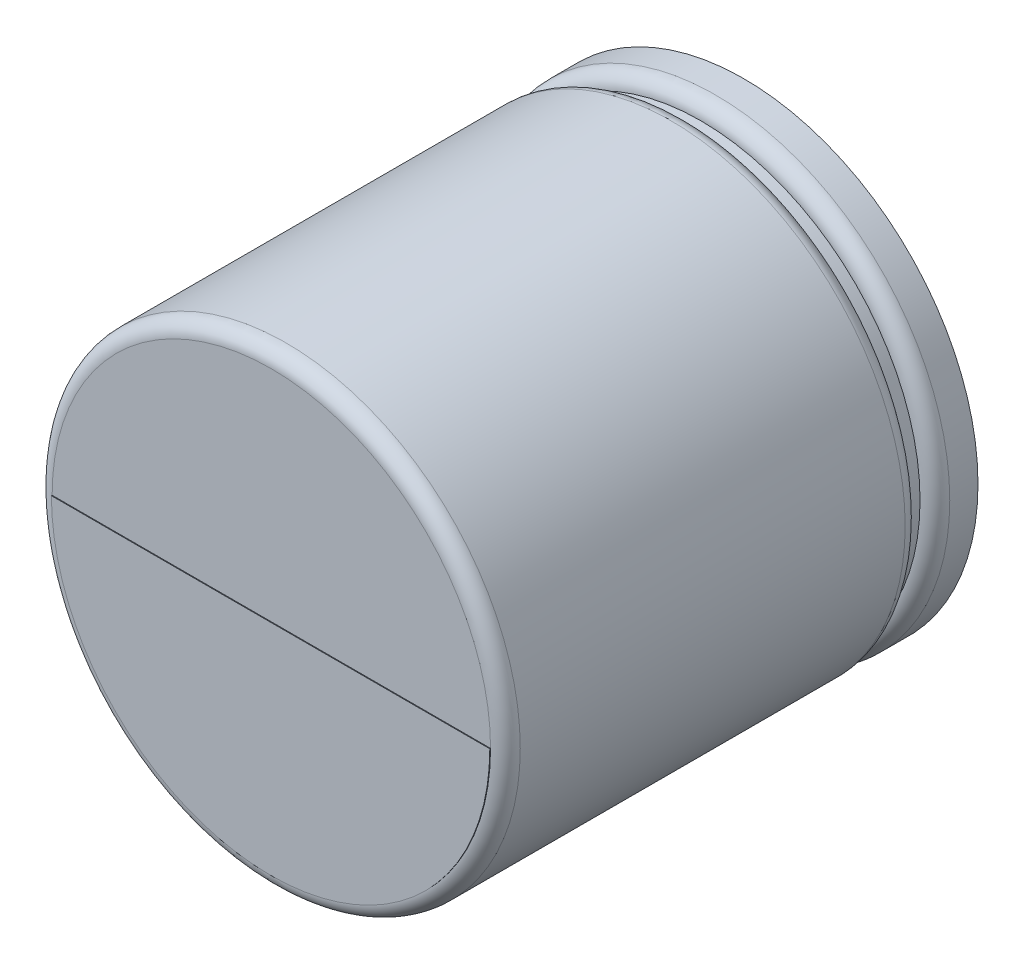
ISO-10303-21;
HEADER;
FILE_DESCRIPTION(('STEP AP214'),'2;1');
FILE_NAME('part.step','',(''),(''),'','','');
FILE_SCHEMA(('AUTOMOTIVE_DESIGN { 1 0 10303 214 1 1 1 1 }'));
ENDSEC;
DATA;
#1=APPLICATION_CONTEXT('core data for automotive mechanical design processes');
#2=APPLICATION_PROTOCOL_DEFINITION('international standard','automotive_design',2000,#1);
#3=PRODUCT_CONTEXT('',#1,'mechanical');
#4=PRODUCT('Part','Part','',(#3));
#5=PRODUCT_RELATED_PRODUCT_CATEGORY('part','',(#4));
#6=PRODUCT_DEFINITION_FORMATION('','',#4);
#7=PRODUCT_DEFINITION_CONTEXT('part definition',#1,'design');
#8=PRODUCT_DEFINITION('design','',#6,#7);
#9=PRODUCT_DEFINITION_SHAPE('','',#8);
#10=(LENGTH_UNIT() NAMED_UNIT(*) SI_UNIT(.MILLI.,.METRE.));
#11=(NAMED_UNIT(*) PLANE_ANGLE_UNIT() SI_UNIT($,.RADIAN.));
#12=(NAMED_UNIT(*) SI_UNIT($,.STERADIAN.) SOLID_ANGLE_UNIT());
#13=UNCERTAINTY_MEASURE_WITH_UNIT(LENGTH_MEASURE(1.E-05),#10,'distance_accuracy_value','');
#14=(GEOMETRIC_REPRESENTATION_CONTEXT(3) GLOBAL_UNCERTAINTY_ASSIGNED_CONTEXT((#13)) GLOBAL_UNIT_ASSIGNED_CONTEXT((#10,
#11,#12)) REPRESENTATION_CONTEXT('',''));
#15=CARTESIAN_POINT('',(0.,0.,0.));
#16=DIRECTION('',(0.,0.,1.));
#17=DIRECTION('',(1.,0.,0.));
#18=AXIS2_PLACEMENT_3D('',#15,#16,#17);
#19=CARTESIAN_POINT('',(3.150002540429,-2.81420062,0.64000126));
#20=DIRECTION('',(0.,0.,-1.));
#21=DIRECTION('',(-1.,0.,0.));
#22=AXIS2_PLACEMENT_3D('',#19,#20,#21);
#23=PLANE('',#22);
#24=CARTESIAN_POINT('',(2.540198607087E-06,-2.81420062,0.64000126));
#25=DIRECTION('',(0.,0.,1.));
#26=DIRECTION('',(1.,0.,0.));
#27=AXIS2_PLACEMENT_3D('',#24,#25,#26);
#28=CIRCLE('',#27,3.15000000023);
#29=CARTESIAN_POINT('',(3.15000254042861,-2.81420062,0.640001259999999));
#30=VERTEX_POINT('',#29);
#31=EDGE_CURVE('E98',#30,#30,#28,.T.);
#32=ORIENTED_EDGE('',*,*,#31,.F.);
#33=EDGE_LOOP('',(#32));
#34=FACE_BOUND('',#33,.T.);
#35=ADVANCED_FACE('F17',(#34),#23,.T.);
#36=CARTESIAN_POINT('',(2.540198607087E-06,-2.81420062,0.64000126));
#37=DIRECTION('',(0.,0.,1.));
#38=DIRECTION('',(1.,0.,0.));
#39=AXIS2_PLACEMENT_3D('',#36,#37,#38);
#40=CYLINDRICAL_SURFACE('',#39,3.15000000023);
#41=ORIENTED_EDGE('',*,*,#31,.T.);
#42=EDGE_LOOP('',(#41));
#43=FACE_BOUND('',#42,.T.);
#44=CARTESIAN_POINT('',(2.540198607015E-06,-2.81420062,1.01999996));
#45=DIRECTION('',(0.,0.,1.));
#46=DIRECTION('',(1.,0.,0.));
#47=AXIS2_PLACEMENT_3D('',#44,#45,#46);
#48=CIRCLE('',#47,3.15000000023);
#49=CARTESIAN_POINT('',(3.15000254042861,-2.81420062,1.01999996));
#50=VERTEX_POINT('',#49);
#51=EDGE_CURVE('E53',#50,#50,#48,.T.);
#52=ORIENTED_EDGE('',*,*,#51,.F.);
#53=EDGE_LOOP('',(#52));
#54=FACE_BOUND('',#53,.T.);
#55=ADVANCED_FACE('F109',(#43,#54),#40,.T.);
#56=CARTESIAN_POINT('',(2.949997460031,-2.81420062,7.01000126));
#57=DIRECTION('',(0.,-1.,0.));
#58=DIRECTION('',(1.,0.,0.));
#59=AXIS2_PLACEMENT_3D('',#56,#57,#58);
#60=PLANE('',#59);
#61=DIRECTION('',(0.,0.,1.));
#62=VECTOR('',#61,1.);
#63=CARTESIAN_POINT('',(-2.949997460031,-2.81420062,7.01000126));
#64=LINE('',#63,#62);
#65=CARTESIAN_POINT('',(-2.9499961899317,-2.81420062,7.01000126));
#66=VERTEX_POINT('',#65);
#67=CARTESIAN_POINT('',(-2.9499966132982,-2.81420062,7.00000125998925));
#68=VERTEX_POINT('',#67);
#69=EDGE_CURVE('E35',#66,#68,#64,.F.);
#70=ORIENTED_EDGE('',*,*,#69,.F.);
#71=DIRECTION('',(1.,0.,0.));
#72=VECTOR('',#71,1.);
#73=CARTESIAN_POINT('',(2.54019860874E-06,-2.81420062,7.01000126));
#74=LINE('',#73,#72);
#75=CARTESIAN_POINT('',(2.9499987301303,-2.81420062,7.01000126));
#76=VERTEX_POINT('',#75);
#77=EDGE_CURVE('E60',#76,#66,#74,.F.);
#78=ORIENTED_EDGE('',*,*,#77,.F.);
#79=DIRECTION('',(0.,0.,1.));
#80=VECTOR('',#79,1.);
#81=CARTESIAN_POINT('',(2.949997460031,-2.81420062,7.01000126));
#82=LINE('',#81,#80);
#83=CARTESIAN_POINT('',(2.9499997507459,-2.81420062,7.00000125999114));
#84=VERTEX_POINT('',#83);
#85=EDGE_CURVE('E43',#84,#76,#82,.T.);
#86=ORIENTED_EDGE('',*,*,#85,.F.);
#87=DIRECTION('',(1.,0.,0.));
#88=VECTOR('',#87,1.);
#89=CARTESIAN_POINT('',(2.540198607794E-06,-2.81420062,7.00000126));
#90=LINE('',#89,#88);
#91=EDGE_CURVE('E56',#68,#84,#90,.T.);
#92=ORIENTED_EDGE('',*,*,#91,.F.);
#93=EDGE_LOOP('',(#70,#78,#86,#92));
#94=FACE_BOUND('',#93,.T.);
#95=ADVANCED_FACE('F57',(#94),#60,.F.);
#96=CARTESIAN_POINT('',(2.540198607015E-06,-2.81420062,1.01999996));
#97=DIRECTION('',(0.,0.,1.));
#98=DIRECTION('',(1.,0.,0.));
#99=AXIS2_PLACEMENT_3D('',#96,#97,#98);
#100=TOROIDAL_SURFACE('',#99,2.950000000229,0.200000000001);
#101=ORIENTED_EDGE('',*,*,#51,.T.);
#102=EDGE_LOOP('',(#101));
#103=FACE_BOUND('',#102,.T.);
#104=CARTESIAN_POINT('',(2.54019860715803E-06,-2.81420062,1.219999960001));
#105=DIRECTION('',(0.,0.,1.));
#106=DIRECTION('',(1.,0.,0.));
#107=AXIS2_PLACEMENT_3D('',#104,#105,#106);
#108=CIRCLE('',#107,2.950000000229);
#109=CARTESIAN_POINT('',(2.95000254042761,-2.81420062,1.219999960001));
#110=VERTEX_POINT('',#109);
#111=EDGE_CURVE('E70',#110,#110,#108,.T.);
#112=ORIENTED_EDGE('',*,*,#111,.F.);
#113=EDGE_LOOP('',(#112));
#114=FACE_BOUND('',#113,.T.);
#115=ADVANCED_FACE('F88',(#103,#114),#100,.T.);
#116=CARTESIAN_POINT('',(2.540198607794E-06,-2.81420062,7.00000126));
#117=DIRECTION('',(0.,0.,1.));
#118=DIRECTION('',(1.,0.,0.));
#119=AXIS2_PLACEMENT_3D('',#116,#117,#118);
#120=PLANE('',#119);
#121=CARTESIAN_POINT('',(2.54019860790649E-06,-2.81420062,7.00000126));
#122=DIRECTION('',(0.,0.,-1.));
#123=DIRECTION('',(-1.,0.,0.));
#124=AXIS2_PLACEMENT_3D('',#121,#122,#123);
#125=CIRCLE('',#124,2.9500000002298);
#126=EDGE_CURVE('E65',#68,#84,#125,.T.);
#127=ORIENTED_EDGE('',*,*,#126,.F.);
#128=ORIENTED_EDGE('',*,*,#91,.T.);
#129=EDGE_LOOP('',(#127,#128));
#130=FACE_BOUND('',#129,.T.);
#131=ADVANCED_FACE('F69',(#130),#120,.T.);
#132=CARTESIAN_POINT('',(2.54019860874E-06,-2.81420062,7.01000126));
#133=DIRECTION('',(0.,0.,1.));
#134=DIRECTION('',(1.,0.,0.));
#135=AXIS2_PLACEMENT_3D('',#132,#133,#134);
#136=PLANE('',#135);
#137=CARTESIAN_POINT('',(2.54019860874E-06,-2.81420062,7.01000126));
#138=DIRECTION('',(0.,0.,-1.));
#139=DIRECTION('',(-1.,0.,0.));
#140=AXIS2_PLACEMENT_3D('',#137,#138,#139);
#141=CIRCLE('',#140,2.949997460031);
#142=EDGE_CURVE('E52',#76,#66,#141,.T.);
#143=ORIENTED_EDGE('',*,*,#142,.F.);
#144=ORIENTED_EDGE('',*,*,#77,.T.);
#145=EDGE_LOOP('',(#143,#144));
#146=FACE_BOUND('',#145,.T.);
#147=ADVANCED_FACE('F87',(#146),#136,.T.);
#148=CARTESIAN_POINT('',(2.540198607087E-06,-2.81420062,0.64000126));
#149=DIRECTION('',(0.,0.,1.));
#150=DIRECTION('',(1.,0.,0.));
#151=AXIS2_PLACEMENT_3D('',#148,#149,#150);
#152=CYLINDRICAL_SURFACE('',#151,2.950000000229);
#153=ORIENTED_EDGE('',*,*,#111,.T.);
#154=EDGE_LOOP('',(#153));
#155=FACE_BOUND('',#154,.T.);
#156=CARTESIAN_POINT('',(2.54019860699051E-06,-2.81420062,1.419999959999));
#157=DIRECTION('',(0.,0.,1.));
#158=DIRECTION('',(1.,0.,0.));
#159=AXIS2_PLACEMENT_3D('',#156,#157,#158);
#160=CIRCLE('',#159,2.95000000022961);
#161=CARTESIAN_POINT('',(2.95000254042821,-2.81420062,1.419999959999));
#162=VERTEX_POINT('',#161);
#163=EDGE_CURVE('E66',#162,#162,#160,.T.);
#164=ORIENTED_EDGE('',*,*,#163,.F.);
#165=EDGE_LOOP('',(#164));
#166=FACE_BOUND('',#165,.T.);
#167=ADVANCED_FACE('F142',(#155,#166),#152,.T.);
#168=CARTESIAN_POINT('',(2.54019860874E-06,-2.81420062,7.01000126));
#169=DIRECTION('',(0.,0.,-1.));
#170=DIRECTION('',(-1.,0.,0.));
#171=AXIS2_PLACEMENT_3D('',#168,#169,#170);
#172=CYLINDRICAL_SURFACE('',#171,2.949997460031);
#173=ORIENTED_EDGE('',*,*,#142,.T.);
#174=ORIENTED_EDGE('',*,*,#69,.T.);
#175=CARTESIAN_POINT('',(2.54019860790649E-06,-2.81420062,7.00000125993548));
#176=DIRECTION('',(0.,0.,1.));
#177=DIRECTION('',(1.,0.,0.));
#178=AXIS2_PLACEMENT_3D('',#175,#176,#177);
#179=CIRCLE('',#178,2.94999491983239);
#180=EDGE_CURVE('E49',#84,#68,#179,.F.);
#181=ORIENTED_EDGE('',*,*,#180,.F.);
#182=ORIENTED_EDGE('',*,*,#85,.T.);
#183=EDGE_LOOP('',(#173,#174,#181,#182));
#184=FACE_BOUND('',#183,.T.);
#185=ADVANCED_FACE('F47',(#184),#172,.T.);
#186=CARTESIAN_POINT('',(2.540198607015E-06,-2.81420062,1.61999996));
#187=DIRECTION('',(0.,0.,1.));
#188=DIRECTION('',(1.,0.,0.));
#189=AXIS2_PLACEMENT_3D('',#186,#187,#188);
#190=TOROIDAL_SURFACE('',#189,2.950000000229,0.200000000001);
#191=ORIENTED_EDGE('',*,*,#163,.T.);
#192=EDGE_LOOP('',(#191));
#193=FACE_BOUND('',#192,.T.);
#194=CARTESIAN_POINT('',(2.54019860720702E-06,-2.81420062,1.61999996));
#195=DIRECTION('',(0.,0.,1.));
#196=DIRECTION('',(1.,0.,0.));
#197=AXIS2_PLACEMENT_3D('',#194,#195,#196);
#198=CIRCLE('',#197,3.15000000023);
#199=CARTESIAN_POINT('',(3.15000254042861,-2.81420062,1.61999996));
#200=VERTEX_POINT('',#199);
#201=EDGE_CURVE('E27',#200,#200,#198,.T.);
#202=ORIENTED_EDGE('',*,*,#201,.F.);
#203=EDGE_LOOP('',(#202));
#204=FACE_BOUND('',#203,.T.);
#205=ADVANCED_FACE('F124',(#193,#204),#190,.T.);
#206=CARTESIAN_POINT('',(2.540198607882E-06,-2.81420062,6.80000126));
#207=DIRECTION('',(0.,0.,1.));
#208=DIRECTION('',(1.,0.,0.));
#209=AXIS2_PLACEMENT_3D('',#206,#207,#208);
#210=TOROIDAL_SURFACE('',#209,2.95000000023,0.2);
#211=ORIENTED_EDGE('',*,*,#180,.T.);
#212=ORIENTED_EDGE('',*,*,#126,.T.);
#213=EDGE_LOOP('',(#211,#212));
#214=FACE_BOUND('',#213,.T.);
#215=CARTESIAN_POINT('',(2.54019860784138E-06,-2.81420062,6.80000126));
#216=DIRECTION('',(0.,0.,1.));
#217=DIRECTION('',(1.,0.,0.));
#218=AXIS2_PLACEMENT_3D('',#215,#216,#217);
#219=CIRCLE('',#218,3.15000000023);
#220=CARTESIAN_POINT('',(3.15000254042861,-2.81420062,6.80000126));
#221=VERTEX_POINT('',#220);
#222=EDGE_CURVE('E11',#221,#221,#219,.F.);
#223=ORIENTED_EDGE('',*,*,#222,.F.);
#224=EDGE_LOOP('',(#223));
#225=FACE_BOUND('',#224,.T.);
#226=ADVANCED_FACE('F63',(#214,#225),#210,.T.);
#227=CARTESIAN_POINT('',(2.540198607087E-06,-2.81420062,0.64000126));
#228=DIRECTION('',(0.,0.,1.));
#229=DIRECTION('',(1.,0.,0.));
#230=AXIS2_PLACEMENT_3D('',#227,#228,#229);
#231=CYLINDRICAL_SURFACE('',#230,3.15000000023);
#232=ORIENTED_EDGE('',*,*,#201,.T.);
#233=EDGE_LOOP('',(#232));
#234=FACE_BOUND('',#233,.T.);
#235=ORIENTED_EDGE('',*,*,#222,.T.);
#236=EDGE_LOOP('',(#235));
#237=FACE_BOUND('',#236,.T.);
#238=ADVANCED_FACE('F117',(#234,#237),#231,.T.);
#239=CLOSED_SHELL('',(#35,#55,#95,#115,#131,#147,#167,#185,#205,#226,#238));
#240=MANIFOLD_SOLID_BREP('B1',#239);
#241=ADVANCED_BREP_SHAPE_REPRESENTATION('',(#18,#240),#14);
#242=SHAPE_DEFINITION_REPRESENTATION(#9,#241);
ENDSEC;
END-ISO-10303-21;
